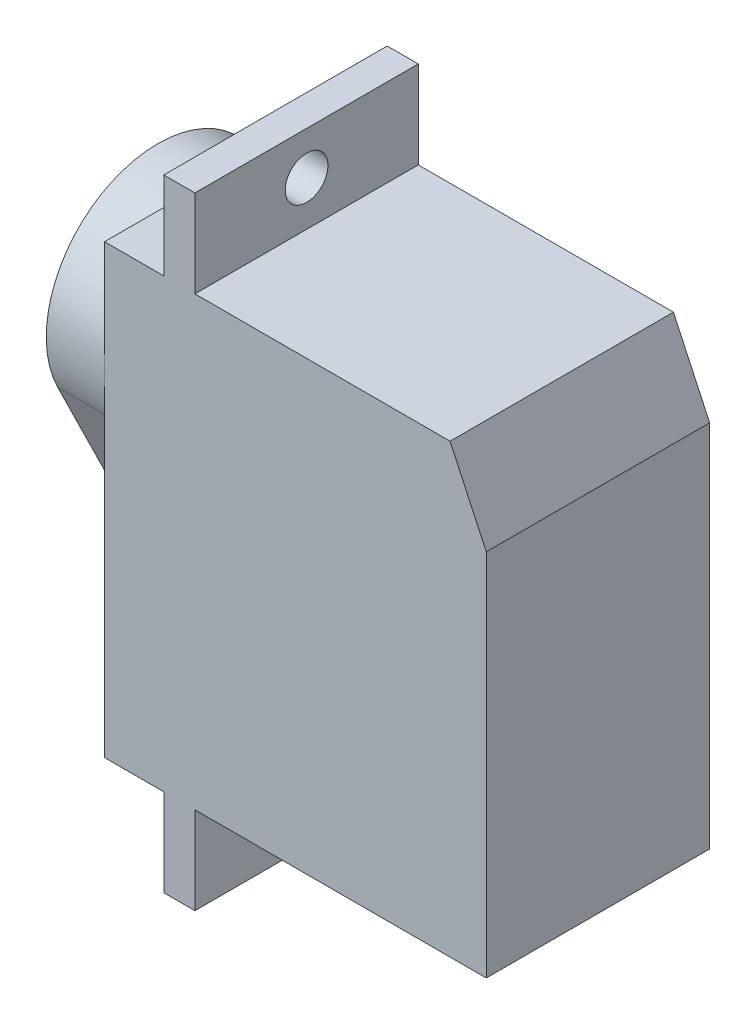
ISO-10303-21;
HEADER;
FILE_DESCRIPTION(('STEP AP214'),'2;1');
FILE_NAME('part.step','',(''),(''),'','','');
FILE_SCHEMA(('AUTOMOTIVE_DESIGN { 1 0 10303 214 1 1 1 1 }'));
ENDSEC;
DATA;
#1=APPLICATION_CONTEXT('core data for automotive mechanical design processes');
#2=APPLICATION_PROTOCOL_DEFINITION('international standard','automotive_design',2000,#1);
#3=PRODUCT_CONTEXT('',#1,'mechanical');
#4=PRODUCT('Part','Part','',(#3));
#5=PRODUCT_RELATED_PRODUCT_CATEGORY('part','',(#4));
#6=PRODUCT_DEFINITION_FORMATION('','',#4);
#7=PRODUCT_DEFINITION_CONTEXT('part definition',#1,'design');
#8=PRODUCT_DEFINITION('design','',#6,#7);
#9=PRODUCT_DEFINITION_SHAPE('','',#8);
#10=(LENGTH_UNIT() NAMED_UNIT(*) SI_UNIT(.MILLI.,.METRE.));
#11=(NAMED_UNIT(*) PLANE_ANGLE_UNIT() SI_UNIT($,.RADIAN.));
#12=(NAMED_UNIT(*) SI_UNIT($,.STERADIAN.) SOLID_ANGLE_UNIT());
#13=UNCERTAINTY_MEASURE_WITH_UNIT(LENGTH_MEASURE(1.E-05),#10,'distance_accuracy_value','');
#14=(GEOMETRIC_REPRESENTATION_CONTEXT(3) GLOBAL_UNCERTAINTY_ASSIGNED_CONTEXT((#13)) GLOBAL_UNIT_ASSIGNED_CONTEXT((#10,
#11,#12)) REPRESENTATION_CONTEXT('',''));
#15=CARTESIAN_POINT('',(0.,0.,0.));
#16=DIRECTION('',(0.,0.,1.));
#17=DIRECTION('',(1.,0.,0.));
#18=AXIS2_PLACEMENT_3D('',#15,#16,#17);
#19=CARTESIAN_POINT('',(-3.,17.25,5.75));
#20=DIRECTION('',(-1.,0.,0.));
#21=DIRECTION('',(0.,0.,1.));
#22=AXIS2_PLACEMENT_3D('',#19,#20,#21);
#23=PLANE('',#22);
#24=CARTESIAN_POINT('',(-3.,9.2,5.75));
#25=DIRECTION('',(-1.,0.,0.));
#26=DIRECTION('',(0.,0.,1.));
#27=AXIS2_PLACEMENT_3D('',#24,#25,#26);
#28=CIRCLE('',#27,1.1);
#29=CARTESIAN_POINT('',(-3.,9.2,6.85));
#30=VERTEX_POINT('',#29);
#31=EDGE_CURVE('E295',#30,#30,#28,.F.);
#32=ORIENTED_EDGE('',*,*,#31,.T.);
#33=EDGE_LOOP('',(#32));
#34=FACE_BOUND('',#33,.T.);
#35=CARTESIAN_POINT('',(-3.,17.25,5.75));
#36=DIRECTION('',(-1.,0.,0.));
#37=DIRECTION('',(0.,0.,1.));
#38=AXIS2_PLACEMENT_3D('',#35,#36,#37);
#39=CIRCLE('',#38,5.75);
#40=CARTESIAN_POINT('',(-3.,14.7142857142857,10.910683390911));
#41=VERTEX_POINT('',#40);
#42=CARTESIAN_POINT('',(-3.,14.7142857142857,0.589316609089016));
#43=VERTEX_POINT('',#42);
#44=EDGE_CURVE('E175',#41,#43,#39,.T.);
#45=ORIENTED_EDGE('',*,*,#44,.T.);
#46=DIRECTION('',(0.,-0.897510154941041,0.440993788819875));
#47=VECTOR('',#46,1.);
#48=CARTESIAN_POINT('',(-3.,14.7142857142857,0.589316609089016));
#49=LINE('',#48,#47);
#50=CARTESIAN_POINT('',(-3.,8.22981366459627,3.77547765912971));
#51=VERTEX_POINT('',#50);
#52=EDGE_CURVE('E164',#43,#51,#49,.T.);
#53=ORIENTED_EDGE('',*,*,#52,.T.);
#54=CARTESIAN_POINT('',(-3.,9.2,5.75));
#55=DIRECTION('',(-1.,0.,0.));
#56=DIRECTION('',(0.,0.,1.));
#57=AXIS2_PLACEMENT_3D('',#54,#55,#56);
#58=CIRCLE('',#57,2.2);
#59=CARTESIAN_POINT('',(-3.,8.22981366459627,7.72452234087029));
#60=VERTEX_POINT('',#59);
#61=EDGE_CURVE('E174',#51,#60,#58,.T.);
#62=ORIENTED_EDGE('',*,*,#61,.T.);
#63=DIRECTION('',(0.,0.897510154941041,0.440993788819876));
#64=VECTOR('',#63,1.);
#65=CARTESIAN_POINT('',(-3.,8.22981366459627,7.72452234087029));
#66=LINE('',#65,#64);
#67=EDGE_CURVE('E180',#60,#41,#66,.T.);
#68=ORIENTED_EDGE('',*,*,#67,.T.);
#69=EDGE_LOOP('',(#45,#53,#62,#68));
#70=FACE_BOUND('',#69,.T.);
#71=CARTESIAN_POINT('',(-3.,17.25,5.75));
#72=DIRECTION('',(-1.,0.,0.));
#73=DIRECTION('',(0.,0.,1.));
#74=AXIS2_PLACEMENT_3D('',#71,#72,#73);
#75=CIRCLE('',#74,2.);
#76=CARTESIAN_POINT('',(-3.,17.25,7.75));
#77=VERTEX_POINT('',#76);
#78=EDGE_CURVE('E467',#77,#77,#75,.T.);
#79=ORIENTED_EDGE('',*,*,#78,.F.);
#80=EDGE_LOOP('',(#79));
#81=FACE_BOUND('',#80,.T.);
#82=ADVANCED_FACE('F36',(#34,#70,#81),#23,.T.);
#83=CARTESIAN_POINT('',(0.,0.,11.5));
#84=DIRECTION('',(1.,0.,0.));
#85=DIRECTION('',(0.,0.,-1.));
#86=AXIS2_PLACEMENT_3D('',#83,#84,#85);
#87=PLANE('',#86);
#88=CARTESIAN_POINT('',(0.,17.25,5.75));
#89=DIRECTION('',(-1.,0.,0.));
#90=DIRECTION('',(0.,0.,1.));
#91=AXIS2_PLACEMENT_3D('',#88,#89,#90);
#92=CIRCLE('',#91,5.75);
#93=CARTESIAN_POINT('',(0.,14.7142857142857,10.910683390911));
#94=VERTEX_POINT('',#93);
#95=CARTESIAN_POINT('',(0.,17.25,11.5));
#96=VERTEX_POINT('',#95);
#97=EDGE_CURVE('E298',#94,#96,#92,.T.);
#98=ORIENTED_EDGE('',*,*,#97,.F.);
#99=DIRECTION('',(0.,0.897510154941041,0.440993788819876));
#100=VECTOR('',#99,1.);
#101=CARTESIAN_POINT('',(0.,8.22981366459627,7.72452234087029));
#102=LINE('',#101,#100);
#103=CARTESIAN_POINT('',(0.,8.22981366459627,7.72452234087029));
#104=VERTEX_POINT('',#103);
#105=EDGE_CURVE('E184',#104,#94,#102,.T.);
#106=ORIENTED_EDGE('',*,*,#105,.F.);
#107=CARTESIAN_POINT('',(0.,9.2,5.75));
#108=DIRECTION('',(-1.,0.,0.));
#109=DIRECTION('',(0.,0.,1.));
#110=AXIS2_PLACEMENT_3D('',#107,#108,#109);
#111=CIRCLE('',#110,2.2);
#112=CARTESIAN_POINT('',(0.,8.22981366459627,3.77547765912971));
#113=VERTEX_POINT('',#112);
#114=EDGE_CURVE('E313',#113,#104,#111,.T.);
#115=ORIENTED_EDGE('',*,*,#114,.F.);
#116=DIRECTION('',(0.,-0.897510154941041,0.440993788819875));
#117=VECTOR('',#116,1.);
#118=CARTESIAN_POINT('',(0.,14.7142857142857,0.589316609089016));
#119=LINE('',#118,#117);
#120=CARTESIAN_POINT('',(0.,14.7142857142857,0.589316609089016));
#121=VERTEX_POINT('',#120);
#122=EDGE_CURVE('E312',#121,#113,#119,.T.);
#123=ORIENTED_EDGE('',*,*,#122,.F.);
#124=CARTESIAN_POINT('',(0.,17.25,0.));
#125=VERTEX_POINT('',#124);
#126=EDGE_CURVE('E190',#125,#121,#92,.T.);
#127=ORIENTED_EDGE('',*,*,#126,.F.);
#128=DIRECTION('',(0.,-1.,0.));
#129=VECTOR('',#128,1.);
#130=CARTESIAN_POINT('',(0.,0.,0.));
#131=LINE('',#130,#129);
#132=CARTESIAN_POINT('',(0.,0.,0.));
#133=VERTEX_POINT('',#132);
#134=EDGE_CURVE('E206',#125,#133,#131,.T.);
#135=ORIENTED_EDGE('',*,*,#134,.T.);
#136=DIRECTION('',(0.,0.,-1.));
#137=VECTOR('',#136,1.);
#138=CARTESIAN_POINT('',(0.,0.,11.5));
#139=LINE('',#138,#137);
#140=CARTESIAN_POINT('',(0.,0.,11.5));
#141=VERTEX_POINT('',#140);
#142=EDGE_CURVE('E290',#141,#133,#139,.T.);
#143=ORIENTED_EDGE('',*,*,#142,.F.);
#144=DIRECTION('',(0.,-1.,0.));
#145=VECTOR('',#144,1.);
#146=CARTESIAN_POINT('',(0.,0.,11.5));
#147=LINE('',#146,#145);
#148=EDGE_CURVE('E211',#96,#141,#147,.T.);
#149=ORIENTED_EDGE('',*,*,#148,.F.);
#150=EDGE_LOOP('',(#98,#106,#115,#123,#127,#135,#143,#149));
#151=FACE_BOUND('',#150,.T.);
#152=ADVANCED_FACE('F327',(#151),#87,.F.);
#153=CARTESIAN_POINT('',(0.,23.,5.75));
#154=VERTEX_POINT('',#153);
#155=EDGE_CURVE('E303',#96,#154,#92,.T.);
#156=ORIENTED_EDGE('',*,*,#155,.F.);
#157=CARTESIAN_POINT('',(0.,23.,11.5));
#158=VERTEX_POINT('',#157);
#159=EDGE_CURVE('E207',#158,#96,#147,.T.);
#160=ORIENTED_EDGE('',*,*,#159,.F.);
#161=DIRECTION('',(0.,0.,-1.));
#162=VECTOR('',#161,1.);
#163=CARTESIAN_POINT('',(0.,23.,11.5));
#164=LINE('',#163,#162);
#165=EDGE_CURVE('E260',#158,#154,#164,.T.);
#166=ORIENTED_EDGE('',*,*,#165,.T.);
#167=EDGE_LOOP('',(#156,#160,#166));
#168=FACE_BOUND('',#167,.T.);
#169=ADVANCED_FACE('F337',(#168),#87,.F.);
#170=EDGE_CURVE('E308',#154,#125,#92,.T.);
#171=ORIENTED_EDGE('',*,*,#170,.F.);
#172=CARTESIAN_POINT('',(0.,23.,0.));
#173=VERTEX_POINT('',#172);
#174=EDGE_CURVE('E233',#154,#173,#164,.T.);
#175=ORIENTED_EDGE('',*,*,#174,.T.);
#176=EDGE_CURVE('E234',#173,#125,#131,.T.);
#177=ORIENTED_EDGE('',*,*,#176,.T.);
#178=EDGE_LOOP('',(#171,#175,#177));
#179=FACE_BOUND('',#178,.T.);
#180=ADVANCED_FACE('F344',(#179),#87,.F.);
#181=CARTESIAN_POINT('',(0.,0.,11.5));
#182=DIRECTION('',(0.,1.,0.));
#183=DIRECTION('',(0.,0.,1.));
#184=AXIS2_PLACEMENT_3D('',#181,#182,#183);
#185=PLANE('',#184);
#186=DIRECTION('',(1.,0.,0.));
#187=VECTOR('',#186,1.);
#188=CARTESIAN_POINT('',(0.,0.,0.));
#189=LINE('',#188,#187);
#190=CARTESIAN_POINT('',(3.05,0.,0.));
#191=VERTEX_POINT('',#190);
#192=EDGE_CURVE('E237',#133,#191,#189,.T.);
#193=ORIENTED_EDGE('',*,*,#192,.T.);
#194=DIRECTION('',(0.,0.,-1.));
#195=VECTOR('',#194,1.);
#196=CARTESIAN_POINT('',(3.05,0.,11.5));
#197=LINE('',#196,#195);
#198=CARTESIAN_POINT('',(3.05,0.,11.5));
#199=VERTEX_POINT('',#198);
#200=EDGE_CURVE('E287',#199,#191,#197,.T.);
#201=ORIENTED_EDGE('',*,*,#200,.F.);
#202=DIRECTION('',(1.,0.,0.));
#203=VECTOR('',#202,1.);
#204=CARTESIAN_POINT('',(0.,0.,11.5));
#205=LINE('',#204,#203);
#206=EDGE_CURVE('E210',#141,#199,#205,.T.);
#207=ORIENTED_EDGE('',*,*,#206,.F.);
#208=ORIENTED_EDGE('',*,*,#142,.T.);
#209=EDGE_LOOP('',(#193,#201,#207,#208));
#210=FACE_BOUND('',#209,.T.);
#211=ADVANCED_FACE('F353',(#210),#185,.F.);
#212=CARTESIAN_POINT('',(3.05,-4.5,11.5));
#213=DIRECTION('',(1.,0.,0.));
#214=DIRECTION('',(0.,0.,-1.));
#215=AXIS2_PLACEMENT_3D('',#212,#213,#214);
#216=PLANE('',#215);
#217=CARTESIAN_POINT('',(3.05,-2.3,5.75));
#218=DIRECTION('',(-1.,0.,0.));
#219=DIRECTION('',(0.,0.,1.));
#220=AXIS2_PLACEMENT_3D('',#217,#218,#219);
#221=CIRCLE('',#220,1.1);
#222=CARTESIAN_POINT('',(3.05,-2.3,6.85));
#223=VERTEX_POINT('',#222);
#224=EDGE_CURVE('E191',#223,#223,#221,.T.);
#225=ORIENTED_EDGE('',*,*,#224,.F.);
#226=EDGE_LOOP('',(#225));
#227=FACE_BOUND('',#226,.T.);
#228=DIRECTION('',(0.,-1.,0.));
#229=VECTOR('',#228,1.);
#230=CARTESIAN_POINT('',(3.05,-4.5,0.));
#231=LINE('',#230,#229);
#232=CARTESIAN_POINT('',(3.05,-4.5,0.));
#233=VERTEX_POINT('',#232);
#234=EDGE_CURVE('E239',#191,#233,#231,.T.);
#235=ORIENTED_EDGE('',*,*,#234,.T.);
#236=DIRECTION('',(0.,0.,-1.));
#237=VECTOR('',#236,1.);
#238=CARTESIAN_POINT('',(3.05,-4.5,11.5));
#239=LINE('',#238,#237);
#240=CARTESIAN_POINT('',(3.05,-4.5,11.5));
#241=VERTEX_POINT('',#240);
#242=EDGE_CURVE('E284',#241,#233,#239,.T.);
#243=ORIENTED_EDGE('',*,*,#242,.F.);
#244=DIRECTION('',(0.,-1.,0.));
#245=VECTOR('',#244,1.);
#246=CARTESIAN_POINT('',(3.05,-4.5,11.5));
#247=LINE('',#246,#245);
#248=EDGE_CURVE('E213',#199,#241,#247,.T.);
#249=ORIENTED_EDGE('',*,*,#248,.F.);
#250=ORIENTED_EDGE('',*,*,#200,.T.);
#251=EDGE_LOOP('',(#235,#243,#249,#250));
#252=FACE_BOUND('',#251,.T.);
#253=ADVANCED_FACE('F359',(#227,#252),#216,.F.);
#254=CARTESIAN_POINT('',(4.65,-4.5,11.5));
#255=DIRECTION('',(0.,1.,0.));
#256=DIRECTION('',(-1.,0.,0.));
#257=AXIS2_PLACEMENT_3D('',#254,#255,#256);
#258=PLANE('',#257);
#259=DIRECTION('',(1.,0.,0.));
#260=VECTOR('',#259,1.);
#261=CARTESIAN_POINT('',(4.65,-4.5,0.));
#262=LINE('',#261,#260);
#263=CARTESIAN_POINT('',(4.65,-4.5,0.));
#264=VERTEX_POINT('',#263);
#265=EDGE_CURVE('E241',#233,#264,#262,.T.);
#266=ORIENTED_EDGE('',*,*,#265,.T.);
#267=DIRECTION('',(0.,0.,-1.));
#268=VECTOR('',#267,1.);
#269=CARTESIAN_POINT('',(4.65,-4.5,11.5));
#270=LINE('',#269,#268);
#271=CARTESIAN_POINT('',(4.65,-4.5,11.5));
#272=VERTEX_POINT('',#271);
#273=EDGE_CURVE('E281',#272,#264,#270,.T.);
#274=ORIENTED_EDGE('',*,*,#273,.F.);
#275=DIRECTION('',(1.,0.,0.));
#276=VECTOR('',#275,1.);
#277=CARTESIAN_POINT('',(4.65,-4.5,11.5));
#278=LINE('',#277,#276);
#279=EDGE_CURVE('E215',#241,#272,#278,.T.);
#280=ORIENTED_EDGE('',*,*,#279,.F.);
#281=ORIENTED_EDGE('',*,*,#242,.T.);
#282=EDGE_LOOP('',(#266,#274,#280,#281));
#283=FACE_BOUND('',#282,.T.);
#284=ADVANCED_FACE('F361',(#283),#258,.F.);
#285=CARTESIAN_POINT('',(4.65,-4.5,11.5));
#286=DIRECTION('',(-1.,0.,0.));
#287=DIRECTION('',(0.,0.,1.));
#288=AXIS2_PLACEMENT_3D('',#285,#286,#287);
#289=PLANE('',#288);
#290=CARTESIAN_POINT('',(4.65,-2.3,5.75));
#291=DIRECTION('',(-1.,0.,0.));
#292=DIRECTION('',(0.,0.,1.));
#293=AXIS2_PLACEMENT_3D('',#290,#291,#292);
#294=CIRCLE('',#293,1.1);
#295=CARTESIAN_POINT('',(4.65,-2.3,6.85));
#296=VERTEX_POINT('',#295);
#297=EDGE_CURVE('E194',#296,#296,#294,.T.);
#298=ORIENTED_EDGE('',*,*,#297,.T.);
#299=EDGE_LOOP('',(#298));
#300=FACE_BOUND('',#299,.T.);
#301=DIRECTION('',(0.,1.,0.));
#302=VECTOR('',#301,1.);
#303=CARTESIAN_POINT('',(4.65,-4.5,0.));
#304=LINE('',#303,#302);
#305=CARTESIAN_POINT('',(4.65,0.,0.));
#306=VERTEX_POINT('',#305);
#307=EDGE_CURVE('E243',#264,#306,#304,.T.);
#308=ORIENTED_EDGE('',*,*,#307,.T.);
#309=DIRECTION('',(0.,0.,-1.));
#310=VECTOR('',#309,1.);
#311=CARTESIAN_POINT('',(4.65,0.,11.5));
#312=LINE('',#311,#310);
#313=CARTESIAN_POINT('',(4.65,0.,11.5));
#314=VERTEX_POINT('',#313);
#315=EDGE_CURVE('E278',#314,#306,#312,.T.);
#316=ORIENTED_EDGE('',*,*,#315,.F.);
#317=DIRECTION('',(0.,1.,0.));
#318=VECTOR('',#317,1.);
#319=CARTESIAN_POINT('',(4.65,-4.5,11.5));
#320=LINE('',#319,#318);
#321=EDGE_CURVE('E217',#272,#314,#320,.T.);
#322=ORIENTED_EDGE('',*,*,#321,.F.);
#323=ORIENTED_EDGE('',*,*,#273,.T.);
#324=EDGE_LOOP('',(#308,#316,#322,#323));
#325=FACE_BOUND('',#324,.T.);
#326=ADVANCED_FACE('F366',(#300,#325),#289,.F.);
#327=CARTESIAN_POINT('',(4.65,0.,11.5));
#328=DIRECTION('',(0.,1.,0.));
#329=DIRECTION('',(0.,0.,1.));
#330=AXIS2_PLACEMENT_3D('',#327,#328,#329);
#331=PLANE('',#330);
#332=DIRECTION('',(1.,0.,0.));
#333=VECTOR('',#332,1.);
#334=CARTESIAN_POINT('',(4.65,0.,0.));
#335=LINE('',#334,#333);
#336=CARTESIAN_POINT('',(19.65,0.,0.));
#337=VERTEX_POINT('',#336);
#338=EDGE_CURVE('E245',#306,#337,#335,.T.);
#339=ORIENTED_EDGE('',*,*,#338,.T.);
#340=DIRECTION('',(0.,0.,-1.));
#341=VECTOR('',#340,1.);
#342=CARTESIAN_POINT('',(19.65,0.,11.5));
#343=LINE('',#342,#341);
#344=CARTESIAN_POINT('',(19.65,0.,11.5));
#345=VERTEX_POINT('',#344);
#346=EDGE_CURVE('E275',#345,#337,#343,.T.);
#347=ORIENTED_EDGE('',*,*,#346,.F.);
#348=DIRECTION('',(1.,0.,0.));
#349=VECTOR('',#348,1.);
#350=CARTESIAN_POINT('',(4.65,0.,11.5));
#351=LINE('',#350,#349);
#352=EDGE_CURVE('E219',#314,#345,#351,.T.);
#353=ORIENTED_EDGE('',*,*,#352,.F.);
#354=ORIENTED_EDGE('',*,*,#315,.T.);
#355=EDGE_LOOP('',(#339,#347,#353,#354));
#356=FACE_BOUND('',#355,.T.);
#357=ADVANCED_FACE('F371',(#356),#331,.F.);
#358=CARTESIAN_POINT('',(19.65,0.,11.5));
#359=DIRECTION('',(-1.,0.,0.));
#360=DIRECTION('',(0.,0.,1.));
#361=AXIS2_PLACEMENT_3D('',#358,#359,#360);
#362=PLANE('',#361);
#363=DIRECTION('',(0.,1.,0.));
#364=VECTOR('',#363,1.);
#365=CARTESIAN_POINT('',(19.65,0.,0.));
#366=LINE('',#365,#364);
#367=CARTESIAN_POINT('',(19.65,19.,0.));
#368=VERTEX_POINT('',#367);
#369=EDGE_CURVE('E247',#337,#368,#366,.T.);
#370=ORIENTED_EDGE('',*,*,#369,.T.);
#371=DIRECTION('',(0.,0.,1.));
#372=VECTOR('',#371,1.);
#373=CARTESIAN_POINT('',(19.65,19.,11.5));
#374=LINE('',#373,#372);
#375=CARTESIAN_POINT('',(19.65,18.9999999999999,11.5));
#376=VERTEX_POINT('',#375);
#377=EDGE_CURVE('E44',#368,#376,#374,.T.);
#378=ORIENTED_EDGE('',*,*,#377,.T.);
#379=DIRECTION('',(0.,1.,0.));
#380=VECTOR('',#379,1.);
#381=CARTESIAN_POINT('',(19.65,0.,11.5));
#382=LINE('',#381,#380);
#383=EDGE_CURVE('E221',#345,#376,#382,.T.);
#384=ORIENTED_EDGE('',*,*,#383,.F.);
#385=ORIENTED_EDGE('',*,*,#346,.T.);
#386=EDGE_LOOP('',(#370,#378,#384,#385));
#387=FACE_BOUND('',#386,.T.);
#388=ADVANCED_FACE('F373',(#387),#362,.F.);
#389=CARTESIAN_POINT('',(4.65,23.,11.5));
#390=DIRECTION('',(0.,-1.,0.));
#391=DIRECTION('',(0.,0.,-1.));
#392=AXIS2_PLACEMENT_3D('',#389,#390,#391);
#393=PLANE('',#392);
#394=DIRECTION('',(-1.,0.,0.));
#395=VECTOR('',#394,1.);
#396=CARTESIAN_POINT('',(4.65,23.,11.5));
#397=LINE('',#396,#395);
#398=CARTESIAN_POINT('',(17.78476936738,23.,11.5));
#399=VERTEX_POINT('',#398);
#400=CARTESIAN_POINT('',(4.65,23.,11.5));
#401=VERTEX_POINT('',#400);
#402=EDGE_CURVE('E223',#399,#401,#397,.T.);
#403=ORIENTED_EDGE('',*,*,#402,.F.);
#404=DIRECTION('',(0.,0.,-1.));
#405=VECTOR('',#404,1.);
#406=CARTESIAN_POINT('',(17.78476936738,23.,11.5));
#407=LINE('',#406,#405);
#408=CARTESIAN_POINT('',(17.78476936738,23.,0.));
#409=VERTEX_POINT('',#408);
#410=EDGE_CURVE('E300',#399,#409,#407,.T.);
#411=ORIENTED_EDGE('',*,*,#410,.T.);
#412=DIRECTION('',(-1.,0.,0.));
#413=VECTOR('',#412,1.);
#414=CARTESIAN_POINT('',(4.65,23.,0.));
#415=LINE('',#414,#413);
#416=CARTESIAN_POINT('',(4.65,23.,0.));
#417=VERTEX_POINT('',#416);
#418=EDGE_CURVE('E249',#409,#417,#415,.T.);
#419=ORIENTED_EDGE('',*,*,#418,.T.);
#420=DIRECTION('',(0.,0.,-1.));
#421=VECTOR('',#420,1.);
#422=CARTESIAN_POINT('',(4.65,23.,11.5));
#423=LINE('',#422,#421);
#424=EDGE_CURVE('E272',#401,#417,#423,.T.);
#425=ORIENTED_EDGE('',*,*,#424,.F.);
#426=EDGE_LOOP('',(#403,#411,#419,#425));
#427=FACE_BOUND('',#426,.T.);
#428=ADVANCED_FACE('F375',(#427),#393,.F.);
#429=CARTESIAN_POINT('',(4.65,23.,11.5));
#430=DIRECTION('',(-1.,0.,0.));
#431=DIRECTION('',(0.,0.,1.));
#432=AXIS2_PLACEMENT_3D('',#429,#430,#431);
#433=PLANE('',#432);
#434=CARTESIAN_POINT('',(4.65,25.3,5.75));
#435=DIRECTION('',(-1.,0.,0.));
#436=DIRECTION('',(0.,0.,1.));
#437=AXIS2_PLACEMENT_3D('',#434,#435,#436);
#438=CIRCLE('',#437,1.1);
#439=CARTESIAN_POINT('',(4.65,25.3,6.85));
#440=VERTEX_POINT('',#439);
#441=EDGE_CURVE('E203',#440,#440,#438,.T.);
#442=ORIENTED_EDGE('',*,*,#441,.T.);
#443=EDGE_LOOP('',(#442));
#444=FACE_BOUND('',#443,.T.);
#445=DIRECTION('',(0.,1.,0.));
#446=VECTOR('',#445,1.);
#447=CARTESIAN_POINT('',(4.65,23.,0.));
#448=LINE('',#447,#446);
#449=CARTESIAN_POINT('',(4.65,27.5,0.));
#450=VERTEX_POINT('',#449);
#451=EDGE_CURVE('E251',#417,#450,#448,.T.);
#452=ORIENTED_EDGE('',*,*,#451,.T.);
#453=DIRECTION('',(0.,0.,-1.));
#454=VECTOR('',#453,1.);
#455=CARTESIAN_POINT('',(4.65,27.5,11.5));
#456=LINE('',#455,#454);
#457=CARTESIAN_POINT('',(4.65,27.5,11.5));
#458=VERTEX_POINT('',#457);
#459=EDGE_CURVE('E269',#458,#450,#456,.T.);
#460=ORIENTED_EDGE('',*,*,#459,.F.);
#461=DIRECTION('',(0.,1.,0.));
#462=VECTOR('',#461,1.);
#463=CARTESIAN_POINT('',(4.65,23.,11.5));
#464=LINE('',#463,#462);
#465=EDGE_CURVE('E225',#401,#458,#464,.T.);
#466=ORIENTED_EDGE('',*,*,#465,.F.);
#467=ORIENTED_EDGE('',*,*,#424,.T.);
#468=EDGE_LOOP('',(#452,#460,#466,#467));
#469=FACE_BOUND('',#468,.T.);
#470=ADVANCED_FACE('F381',(#444,#469),#433,.F.);
#471=CARTESIAN_POINT('',(4.65,27.5,11.5));
#472=DIRECTION('',(0.,-1.,0.));
#473=DIRECTION('',(0.,0.,-1.));
#474=AXIS2_PLACEMENT_3D('',#471,#472,#473);
#475=PLANE('',#474);
#476=DIRECTION('',(-1.,0.,0.));
#477=VECTOR('',#476,1.);
#478=CARTESIAN_POINT('',(4.65,27.5,0.));
#479=LINE('',#478,#477);
#480=CARTESIAN_POINT('',(3.05,27.5,0.));
#481=VERTEX_POINT('',#480);
#482=EDGE_CURVE('E253',#450,#481,#479,.T.);
#483=ORIENTED_EDGE('',*,*,#482,.T.);
#484=DIRECTION('',(0.,0.,-1.));
#485=VECTOR('',#484,1.);
#486=CARTESIAN_POINT('',(3.05,27.5,11.5));
#487=LINE('',#486,#485);
#488=CARTESIAN_POINT('',(3.05,27.5,11.5));
#489=VERTEX_POINT('',#488);
#490=EDGE_CURVE('E266',#489,#481,#487,.T.);
#491=ORIENTED_EDGE('',*,*,#490,.F.);
#492=DIRECTION('',(-1.,0.,0.));
#493=VECTOR('',#492,1.);
#494=CARTESIAN_POINT('',(4.65,27.5,11.5));
#495=LINE('',#494,#493);
#496=EDGE_CURVE('E227',#458,#489,#495,.T.);
#497=ORIENTED_EDGE('',*,*,#496,.F.);
#498=ORIENTED_EDGE('',*,*,#459,.T.);
#499=EDGE_LOOP('',(#483,#491,#497,#498));
#500=FACE_BOUND('',#499,.T.);
#501=ADVANCED_FACE('F419',(#500),#475,.F.);
#502=CARTESIAN_POINT('',(3.05,23.,11.5));
#503=DIRECTION('',(1.,0.,0.));
#504=DIRECTION('',(0.,0.,-1.));
#505=AXIS2_PLACEMENT_3D('',#502,#503,#504);
#506=PLANE('',#505);
#507=CARTESIAN_POINT('',(3.05,25.3,5.75));
#508=DIRECTION('',(-1.,0.,0.));
#509=DIRECTION('',(0.,0.,1.));
#510=AXIS2_PLACEMENT_3D('',#507,#508,#509);
#511=CIRCLE('',#510,1.1);
#512=CARTESIAN_POINT('',(3.05,25.3,6.85));
#513=VERTEX_POINT('',#512);
#514=EDGE_CURVE('E200',#513,#513,#511,.T.);
#515=ORIENTED_EDGE('',*,*,#514,.F.);
#516=EDGE_LOOP('',(#515));
#517=FACE_BOUND('',#516,.T.);
#518=DIRECTION('',(0.,-1.,0.));
#519=VECTOR('',#518,1.);
#520=CARTESIAN_POINT('',(3.05,23.,0.));
#521=LINE('',#520,#519);
#522=CARTESIAN_POINT('',(3.05,23.,0.));
#523=VERTEX_POINT('',#522);
#524=EDGE_CURVE('E255',#481,#523,#521,.T.);
#525=ORIENTED_EDGE('',*,*,#524,.T.);
#526=DIRECTION('',(0.,0.,-1.));
#527=VECTOR('',#526,1.);
#528=CARTESIAN_POINT('',(3.05,23.,11.5));
#529=LINE('',#528,#527);
#530=CARTESIAN_POINT('',(3.05,23.,11.5));
#531=VERTEX_POINT('',#530);
#532=EDGE_CURVE('E263',#531,#523,#529,.T.);
#533=ORIENTED_EDGE('',*,*,#532,.F.);
#534=DIRECTION('',(0.,-1.,0.));
#535=VECTOR('',#534,1.);
#536=CARTESIAN_POINT('',(3.05,23.,11.5));
#537=LINE('',#536,#535);
#538=EDGE_CURVE('E229',#489,#531,#537,.T.);
#539=ORIENTED_EDGE('',*,*,#538,.F.);
#540=ORIENTED_EDGE('',*,*,#490,.T.);
#541=EDGE_LOOP('',(#525,#533,#539,#540));
#542=FACE_BOUND('',#541,.T.);
#543=ADVANCED_FACE('F416',(#517,#542),#506,.F.);
#544=CARTESIAN_POINT('',(0.,23.,11.5));
#545=DIRECTION('',(0.,-1.,0.));
#546=DIRECTION('',(0.,0.,-1.));
#547=AXIS2_PLACEMENT_3D('',#544,#545,#546);
#548=PLANE('',#547);
#549=DIRECTION('',(-1.,0.,0.));
#550=VECTOR('',#549,1.);
#551=CARTESIAN_POINT('',(0.,23.,0.));
#552=LINE('',#551,#550);
#553=EDGE_CURVE('E257',#523,#173,#552,.T.);
#554=ORIENTED_EDGE('',*,*,#553,.T.);
#555=ORIENTED_EDGE('',*,*,#174,.F.);
#556=ORIENTED_EDGE('',*,*,#165,.F.);
#557=DIRECTION('',(-1.,0.,0.));
#558=VECTOR('',#557,1.);
#559=CARTESIAN_POINT('',(0.,23.,11.5));
#560=LINE('',#559,#558);
#561=EDGE_CURVE('E231',#531,#158,#560,.T.);
#562=ORIENTED_EDGE('',*,*,#561,.F.);
#563=ORIENTED_EDGE('',*,*,#532,.T.);
#564=EDGE_LOOP('',(#554,#555,#556,#562,#563));
#565=FACE_BOUND('',#564,.T.);
#566=ADVANCED_FACE('F340',(#565),#548,.F.);
#567=CARTESIAN_POINT('',(0.,0.,11.5));
#568=DIRECTION('',(0.,0.,-1.));
#569=DIRECTION('',(-1.,0.,0.));
#570=AXIS2_PLACEMENT_3D('',#567,#568,#569);
#571=PLANE('',#570);
#572=ORIENTED_EDGE('',*,*,#383,.T.);
#573=DIRECTION('',(0.422618261740697,-0.906307787036651,0.));
#574=VECTOR('',#573,1.);
#575=CARTESIAN_POINT('',(17.78476936738,23.,11.5));
#576=LINE('',#575,#574);
#577=EDGE_CURVE('E11',#376,#399,#576,.F.);
#578=ORIENTED_EDGE('',*,*,#577,.T.);
#579=ORIENTED_EDGE('',*,*,#402,.T.);
#580=ORIENTED_EDGE('',*,*,#465,.T.);
#581=ORIENTED_EDGE('',*,*,#496,.T.);
#582=ORIENTED_EDGE('',*,*,#538,.T.);
#583=ORIENTED_EDGE('',*,*,#561,.T.);
#584=ORIENTED_EDGE('',*,*,#159,.T.);
#585=ORIENTED_EDGE('',*,*,#148,.T.);
#586=ORIENTED_EDGE('',*,*,#206,.T.);
#587=ORIENTED_EDGE('',*,*,#248,.T.);
#588=ORIENTED_EDGE('',*,*,#279,.T.);
#589=ORIENTED_EDGE('',*,*,#321,.T.);
#590=ORIENTED_EDGE('',*,*,#352,.T.);
#591=EDGE_LOOP('',(#572,#578,#579,#580,#581,#582,#583,#584,#585,#586,#587,#588,#589,#590));
#592=FACE_BOUND('',#591,.T.);
#593=ADVANCED_FACE('F333',(#592),#571,.F.);
#594=CARTESIAN_POINT('',(0.,0.,0.));
#595=DIRECTION('',(0.,0.,-1.));
#596=DIRECTION('',(-1.,0.,0.));
#597=AXIS2_PLACEMENT_3D('',#594,#595,#596);
#598=PLANE('',#597);
#599=ORIENTED_EDGE('',*,*,#418,.F.);
#600=DIRECTION('',(-0.422618261740697,0.906307787036651,0.));
#601=VECTOR('',#600,1.);
#602=CARTESIAN_POINT('',(23.4178104748005,10.9199043616218,0.));
#603=LINE('',#602,#601);
#604=EDGE_CURVE('E58',#409,#368,#603,.F.);
#605=ORIENTED_EDGE('',*,*,#604,.T.);
#606=ORIENTED_EDGE('',*,*,#369,.F.);
#607=ORIENTED_EDGE('',*,*,#338,.F.);
#608=ORIENTED_EDGE('',*,*,#307,.F.);
#609=ORIENTED_EDGE('',*,*,#265,.F.);
#610=ORIENTED_EDGE('',*,*,#234,.F.);
#611=ORIENTED_EDGE('',*,*,#192,.F.);
#612=ORIENTED_EDGE('',*,*,#134,.F.);
#613=ORIENTED_EDGE('',*,*,#176,.F.);
#614=ORIENTED_EDGE('',*,*,#553,.F.);
#615=ORIENTED_EDGE('',*,*,#524,.F.);
#616=ORIENTED_EDGE('',*,*,#482,.F.);
#617=ORIENTED_EDGE('',*,*,#451,.F.);
#618=EDGE_LOOP('',(#599,#605,#606,#607,#608,#609,#610,#611,#612,#613,#614,#615,#616,#617));
#619=FACE_BOUND('',#618,.T.);
#620=ADVANCED_FACE('F346',(#619),#598,.T.);
#621=CARTESIAN_POINT('',(19.65,25.3,5.75));
#622=DIRECTION('',(-1.,0.,0.));
#623=DIRECTION('',(0.,0.,1.));
#624=AXIS2_PLACEMENT_3D('',#621,#622,#623);
#625=CYLINDRICAL_SURFACE('',#624,1.1);
#626=ORIENTED_EDGE('',*,*,#514,.T.);
#627=EDGE_LOOP('',(#626));
#628=FACE_BOUND('',#627,.T.);
#629=ORIENTED_EDGE('',*,*,#441,.F.);
#630=EDGE_LOOP('',(#629));
#631=FACE_BOUND('',#630,.T.);
#632=ADVANCED_FACE('F405',(#628,#631),#625,.F.);
#633=CARTESIAN_POINT('',(19.65,-2.3,5.75));
#634=DIRECTION('',(-1.,0.,0.));
#635=DIRECTION('',(0.,0.,1.));
#636=AXIS2_PLACEMENT_3D('',#633,#634,#635);
#637=CYLINDRICAL_SURFACE('',#636,1.1);
#638=ORIENTED_EDGE('',*,*,#224,.T.);
#639=EDGE_LOOP('',(#638));
#640=FACE_BOUND('',#639,.T.);
#641=ORIENTED_EDGE('',*,*,#297,.F.);
#642=EDGE_LOOP('',(#641));
#643=FACE_BOUND('',#642,.T.);
#644=ADVANCED_FACE('F402',(#640,#643),#637,.F.);
#645=CARTESIAN_POINT('',(-3.,17.25,5.75));
#646=DIRECTION('',(1.,0.,0.));
#647=DIRECTION('',(0.,0.,-1.));
#648=AXIS2_PLACEMENT_3D('',#645,#646,#647);
#649=CYLINDRICAL_SURFACE('',#648,5.75);
#650=ORIENTED_EDGE('',*,*,#97,.T.);
#651=ORIENTED_EDGE('',*,*,#155,.T.);
#652=ORIENTED_EDGE('',*,*,#170,.T.);
#653=ORIENTED_EDGE('',*,*,#126,.T.);
#654=DIRECTION('',(1.,0.,0.));
#655=VECTOR('',#654,1.);
#656=CARTESIAN_POINT('',(-3.,14.7142857142857,0.589316609089016));
#657=LINE('',#656,#655);
#658=EDGE_CURVE('E169',#43,#121,#657,.T.);
#659=ORIENTED_EDGE('',*,*,#658,.F.);
#660=ORIENTED_EDGE('',*,*,#44,.F.);
#661=DIRECTION('',(1.,0.,0.));
#662=VECTOR('',#661,1.);
#663=CARTESIAN_POINT('',(-3.,14.7142857142857,10.910683390911));
#664=LINE('',#663,#662);
#665=EDGE_CURVE('E319',#41,#94,#664,.T.);
#666=ORIENTED_EDGE('',*,*,#665,.T.);
#667=EDGE_LOOP('',(#650,#651,#652,#653,#659,#660,#666));
#668=FACE_BOUND('',#667,.T.);
#669=ADVANCED_FACE('F188',(#668),#649,.T.);
#670=CARTESIAN_POINT('',(-3.,14.7142857142857,0.589316609089016));
#671=DIRECTION('',(0.,0.440993788819875,0.897510154941041));
#672=DIRECTION('',(0.,-0.897510154941041,0.440993788819875));
#673=AXIS2_PLACEMENT_3D('',#670,#671,#672);
#674=PLANE('',#673);
#675=ORIENTED_EDGE('',*,*,#122,.T.);
#676=DIRECTION('',(1.,0.,0.));
#677=VECTOR('',#676,1.);
#678=CARTESIAN_POINT('',(-3.,8.22981366459627,3.77547765912971));
#679=LINE('',#678,#677);
#680=EDGE_CURVE('E171',#51,#113,#679,.T.);
#681=ORIENTED_EDGE('',*,*,#680,.F.);
#682=ORIENTED_EDGE('',*,*,#52,.F.);
#683=ORIENTED_EDGE('',*,*,#658,.T.);
#684=EDGE_LOOP('',(#675,#681,#682,#683));
#685=FACE_BOUND('',#684,.T.);
#686=ADVANCED_FACE('F167',(#685),#674,.F.);
#687=CARTESIAN_POINT('',(-3.,9.2,5.75));
#688=DIRECTION('',(1.,0.,0.));
#689=DIRECTION('',(0.,0.,-1.));
#690=AXIS2_PLACEMENT_3D('',#687,#688,#689);
#691=CYLINDRICAL_SURFACE('',#690,2.2);
#692=ORIENTED_EDGE('',*,*,#114,.T.);
#693=DIRECTION('',(1.,0.,0.));
#694=VECTOR('',#693,1.);
#695=CARTESIAN_POINT('',(-3.,8.22981366459627,7.72452234087029));
#696=LINE('',#695,#694);
#697=EDGE_CURVE('E196',#60,#104,#696,.T.);
#698=ORIENTED_EDGE('',*,*,#697,.F.);
#699=ORIENTED_EDGE('',*,*,#61,.F.);
#700=ORIENTED_EDGE('',*,*,#680,.T.);
#701=EDGE_LOOP('',(#692,#698,#699,#700));
#702=FACE_BOUND('',#701,.T.);
#703=ADVANCED_FACE('F325',(#702),#691,.T.);
#704=CARTESIAN_POINT('',(-3.,8.22981366459627,7.72452234087029));
#705=DIRECTION('',(0.,0.440993788819876,-0.89751015494104));
#706=DIRECTION('',(0.,0.897510154941041,0.440993788819876));
#707=AXIS2_PLACEMENT_3D('',#704,#705,#706);
#708=PLANE('',#707);
#709=ORIENTED_EDGE('',*,*,#105,.T.);
#710=ORIENTED_EDGE('',*,*,#665,.F.);
#711=ORIENTED_EDGE('',*,*,#67,.F.);
#712=ORIENTED_EDGE('',*,*,#697,.T.);
#713=EDGE_LOOP('',(#709,#710,#711,#712));
#714=FACE_BOUND('',#713,.T.);
#715=ADVANCED_FACE('F323',(#714),#708,.F.);
#716=CARTESIAN_POINT('',(-3.6,9.2,5.75));
#717=DIRECTION('',(1.,0.,0.));
#718=DIRECTION('',(0.,0.,-1.));
#719=AXIS2_PLACEMENT_3D('',#716,#717,#718);
#720=CYLINDRICAL_SURFACE('',#719,1.1);
#721=ORIENTED_EDGE('',*,*,#31,.F.);
#722=EDGE_LOOP('',(#721));
#723=FACE_BOUND('',#722,.T.);
#724=CARTESIAN_POINT('',(-3.6,9.2,5.75));
#725=DIRECTION('',(-1.,0.,0.));
#726=DIRECTION('',(0.,0.,1.));
#727=AXIS2_PLACEMENT_3D('',#724,#725,#726);
#728=CIRCLE('',#727,1.1);
#729=CARTESIAN_POINT('',(-3.6,9.2,6.85));
#730=VERTEX_POINT('',#729);
#731=EDGE_CURVE('E299',#730,#730,#728,.T.);
#732=ORIENTED_EDGE('',*,*,#731,.F.);
#733=EDGE_LOOP('',(#732));
#734=FACE_BOUND('',#733,.T.);
#735=ADVANCED_FACE('F392',(#723,#734),#720,.T.);
#736=CARTESIAN_POINT('',(-3.6,9.2,5.75));
#737=DIRECTION('',(-1.,0.,0.));
#738=DIRECTION('',(0.,0.,1.));
#739=AXIS2_PLACEMENT_3D('',#736,#737,#738);
#740=PLANE('',#739);
#741=ORIENTED_EDGE('',*,*,#731,.T.);
#742=EDGE_LOOP('',(#741));
#743=FACE_BOUND('',#742,.T.);
#744=ADVANCED_FACE('F452',(#743),#740,.T.);
#745=CARTESIAN_POINT('',(-5.,17.25,5.75));
#746=DIRECTION('',(1.,0.,0.));
#747=DIRECTION('',(0.,0.,-1.));
#748=AXIS2_PLACEMENT_3D('',#745,#746,#747);
#749=CYLINDRICAL_SURFACE('',#748,2.);
#750=CARTESIAN_POINT('',(-5.,17.25,5.75));
#751=DIRECTION('',(-1.,0.,0.));
#752=DIRECTION('',(0.,0.,1.));
#753=AXIS2_PLACEMENT_3D('',#750,#751,#752);
#754=CIRCLE('',#753,2.);
#755=CARTESIAN_POINT('',(-5.,17.25,7.75));
#756=VERTEX_POINT('',#755);
#757=EDGE_CURVE('E465',#756,#756,#754,.T.);
#758=ORIENTED_EDGE('',*,*,#757,.F.);
#759=EDGE_LOOP('',(#758));
#760=FACE_BOUND('',#759,.T.);
#761=ORIENTED_EDGE('',*,*,#78,.T.);
#762=EDGE_LOOP('',(#761));
#763=FACE_BOUND('',#762,.T.);
#764=ADVANCED_FACE('F446',(#760,#763),#749,.T.);
#765=CARTESIAN_POINT('',(-5.,17.25,5.75));
#766=DIRECTION('',(-1.,0.,0.));
#767=DIRECTION('',(0.,0.,1.));
#768=AXIS2_PLACEMENT_3D('',#765,#766,#767);
#769=PLANE('',#768);
#770=ORIENTED_EDGE('',*,*,#757,.T.);
#771=EDGE_LOOP('',(#770));
#772=FACE_BOUND('',#771,.T.);
#773=ADVANCED_FACE('F442',(#772),#769,.T.);
#774=CARTESIAN_POINT('',(17.78476936738,23.,11.5));
#775=DIRECTION('',(-0.906307787036651,-0.422618261740697,0.));
#776=DIRECTION('',(0.,0.,-1.));
#777=AXIS2_PLACEMENT_3D('',#774,#775,#776);
#778=PLANE('',#777);
#779=ORIENTED_EDGE('',*,*,#577,.F.);
#780=ORIENTED_EDGE('',*,*,#377,.F.);
#781=ORIENTED_EDGE('',*,*,#604,.F.);
#782=ORIENTED_EDGE('',*,*,#410,.F.);
#783=EDGE_LOOP('',(#779,#780,#781,#782));
#784=FACE_BOUND('',#783,.T.);
#785=ADVANCED_FACE('F38',(#784),#778,.F.);
#786=CLOSED_SHELL('',(#82,#152,#169,#180,#211,#253,#284,#326,#357,#388,#428,#470,#501,#543,#566,
#593,#620,#632,#644,#669,#686,#703,#715,#735,#744,#764,#773,#785));
#787=MANIFOLD_SOLID_BREP('B2',#786);
#788=ADVANCED_BREP_SHAPE_REPRESENTATION('',(#18,#787),#14);
#789=SHAPE_DEFINITION_REPRESENTATION(#9,#788);
ENDSEC;
END-ISO-10303-21;
